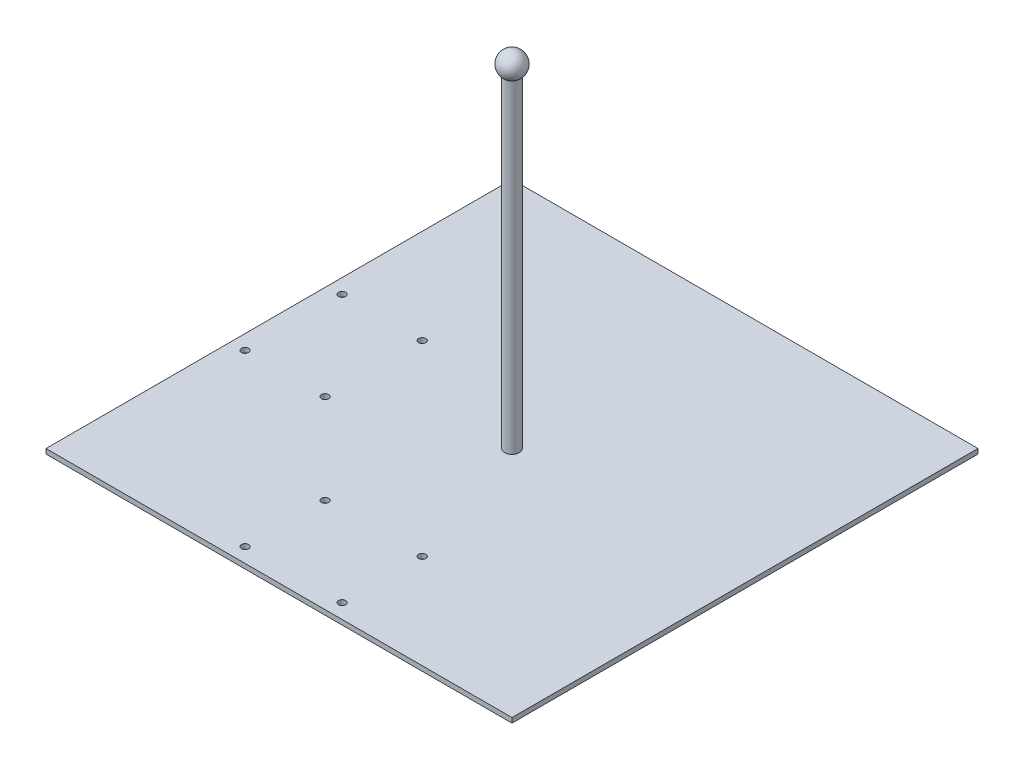
ISO-10303-21;
HEADER;
FILE_DESCRIPTION(('STEP AP214'),'2;1');
FILE_NAME('part.step','',(''),(''),'','','');
FILE_SCHEMA(('AUTOMOTIVE_DESIGN { 1 0 10303 214 1 1 1 1 }'));
ENDSEC;
DATA;
#1=APPLICATION_CONTEXT('core data for automotive mechanical design processes');
#2=APPLICATION_PROTOCOL_DEFINITION('international standard','automotive_design',2000,#1);
#3=PRODUCT_CONTEXT('',#1,'mechanical');
#4=PRODUCT('Part','Part','',(#3));
#5=PRODUCT_RELATED_PRODUCT_CATEGORY('part','',(#4));
#6=PRODUCT_DEFINITION_FORMATION('','',#4);
#7=PRODUCT_DEFINITION_CONTEXT('part definition',#1,'design');
#8=PRODUCT_DEFINITION('design','',#6,#7);
#9=PRODUCT_DEFINITION_SHAPE('','',#8);
#10=(LENGTH_UNIT() NAMED_UNIT(*) SI_UNIT(.MILLI.,.METRE.));
#11=(NAMED_UNIT(*) PLANE_ANGLE_UNIT() SI_UNIT($,.RADIAN.));
#12=(NAMED_UNIT(*) SI_UNIT($,.STERADIAN.) SOLID_ANGLE_UNIT());
#13=UNCERTAINTY_MEASURE_WITH_UNIT(LENGTH_MEASURE(1.E-05),#10,'distance_accuracy_value','');
#14=(GEOMETRIC_REPRESENTATION_CONTEXT(3) GLOBAL_UNCERTAINTY_ASSIGNED_CONTEXT((#13)) GLOBAL_UNIT_ASSIGNED_CONTEXT((#10,
#11,#12)) REPRESENTATION_CONTEXT('',''));
#15=CARTESIAN_POINT('',(0.,0.,0.));
#16=DIRECTION('',(0.,0.,1.));
#17=DIRECTION('',(1.,0.,0.));
#18=AXIS2_PLACEMENT_3D('',#15,#16,#17);
#19=CARTESIAN_POINT('',(-304.8,6.35,304.8));
#20=DIRECTION('',(0.,0.,-1.));
#21=DIRECTION('',(-1.,0.,0.));
#22=AXIS2_PLACEMENT_3D('',#19,#20,#21);
#23=PLANE('',#22);
#24=DIRECTION('',(1.,0.,0.));
#25=VECTOR('',#24,1.);
#26=CARTESIAN_POINT('',(-304.8,0.,304.8));
#27=LINE('',#26,#25);
#28=CARTESIAN_POINT('',(-304.8,0.,304.8));
#29=VERTEX_POINT('',#28);
#30=CARTESIAN_POINT('',(304.8,0.,304.8));
#31=VERTEX_POINT('',#30);
#32=EDGE_CURVE('E98',#29,#31,#27,.T.);
#33=ORIENTED_EDGE('',*,*,#32,.T.);
#34=DIRECTION('',(0.,-1.,0.));
#35=VECTOR('',#34,1.);
#36=CARTESIAN_POINT('',(304.8,6.35,304.8));
#37=LINE('',#36,#35);
#38=CARTESIAN_POINT('',(304.8,6.35,304.8));
#39=VERTEX_POINT('',#38);
#40=EDGE_CURVE('E11',#39,#31,#37,.T.);
#41=ORIENTED_EDGE('',*,*,#40,.F.);
#42=DIRECTION('',(1.,0.,0.));
#43=VECTOR('',#42,1.);
#44=CARTESIAN_POINT('',(-304.8,6.35,304.8));
#45=LINE('',#44,#43);
#46=CARTESIAN_POINT('',(-304.8,6.35,304.8));
#47=VERTEX_POINT('',#46);
#48=EDGE_CURVE('E83',#47,#39,#45,.T.);
#49=ORIENTED_EDGE('',*,*,#48,.F.);
#50=DIRECTION('',(0.,-1.,0.));
#51=VECTOR('',#50,1.);
#52=CARTESIAN_POINT('',(-304.8,6.35,304.8));
#53=LINE('',#52,#51);
#54=EDGE_CURVE('E50',#47,#29,#53,.T.);
#55=ORIENTED_EDGE('',*,*,#54,.T.);
#56=EDGE_LOOP('',(#33,#41,#49,#55));
#57=FACE_BOUND('',#56,.T.);
#58=ADVANCED_FACE('F33',(#57),#23,.F.);
#59=CARTESIAN_POINT('',(304.8,6.35,304.8));
#60=DIRECTION('',(-1.,0.,0.));
#61=DIRECTION('',(0.,0.,1.));
#62=AXIS2_PLACEMENT_3D('',#59,#60,#61);
#63=PLANE('',#62);
#64=DIRECTION('',(0.,0.,-1.));
#65=VECTOR('',#64,1.);
#66=CARTESIAN_POINT('',(304.8,0.,304.8));
#67=LINE('',#66,#65);
#68=CARTESIAN_POINT('',(304.8,0.,-304.8));
#69=VERTEX_POINT('',#68);
#70=EDGE_CURVE('E88',#31,#69,#67,.T.);
#71=ORIENTED_EDGE('',*,*,#70,.T.);
#72=DIRECTION('',(0.,-1.,0.));
#73=VECTOR('',#72,1.);
#74=CARTESIAN_POINT('',(304.8,6.35,-304.8));
#75=LINE('',#74,#73);
#76=CARTESIAN_POINT('',(304.8,6.35,-304.8));
#77=VERTEX_POINT('',#76);
#78=EDGE_CURVE('E42',#77,#69,#75,.T.);
#79=ORIENTED_EDGE('',*,*,#78,.F.);
#80=DIRECTION('',(0.,0.,-1.));
#81=VECTOR('',#80,1.);
#82=CARTESIAN_POINT('',(304.8,6.35,304.8));
#83=LINE('',#82,#81);
#84=EDGE_CURVE('E75',#39,#77,#83,.T.);
#85=ORIENTED_EDGE('',*,*,#84,.F.);
#86=ORIENTED_EDGE('',*,*,#40,.T.);
#87=EDGE_LOOP('',(#71,#79,#85,#86));
#88=FACE_BOUND('',#87,.T.);
#89=ADVANCED_FACE('F87',(#88),#63,.F.);
#90=CARTESIAN_POINT('',(-304.8,6.35,-304.8));
#91=DIRECTION('',(0.,0.,-1.));
#92=DIRECTION('',(-1.,0.,0.));
#93=AXIS2_PLACEMENT_3D('',#90,#91,#92);
#94=PLANE('',#93);
#95=DIRECTION('',(1.,0.,0.));
#96=VECTOR('',#95,1.);
#97=CARTESIAN_POINT('',(-304.8,0.,-304.8));
#98=LINE('',#97,#96);
#99=CARTESIAN_POINT('',(-304.8,0.,-304.8));
#100=VERTEX_POINT('',#99);
#101=EDGE_CURVE('E102',#100,#69,#98,.T.);
#102=ORIENTED_EDGE('',*,*,#101,.F.);
#103=DIRECTION('',(0.,-1.,0.));
#104=VECTOR('',#103,1.);
#105=CARTESIAN_POINT('',(-304.8,6.35,-304.8));
#106=LINE('',#105,#104);
#107=CARTESIAN_POINT('',(-304.8,6.35,-304.8));
#108=VERTEX_POINT('',#107);
#109=EDGE_CURVE('E64',#108,#100,#106,.T.);
#110=ORIENTED_EDGE('',*,*,#109,.F.);
#111=DIRECTION('',(1.,0.,0.));
#112=VECTOR('',#111,1.);
#113=CARTESIAN_POINT('',(-304.8,6.35,-304.8));
#114=LINE('',#113,#112);
#115=EDGE_CURVE('E82',#108,#77,#114,.T.);
#116=ORIENTED_EDGE('',*,*,#115,.T.);
#117=ORIENTED_EDGE('',*,*,#78,.T.);
#118=EDGE_LOOP('',(#102,#110,#116,#117));
#119=FACE_BOUND('',#118,.T.);
#120=ADVANCED_FACE('F92',(#119),#94,.T.);
#121=CARTESIAN_POINT('',(-304.8,6.35,304.8));
#122=DIRECTION('',(-1.,0.,0.));
#123=DIRECTION('',(0.,0.,1.));
#124=AXIS2_PLACEMENT_3D('',#121,#122,#123);
#125=PLANE('',#124);
#126=DIRECTION('',(0.,0.,-1.));
#127=VECTOR('',#126,1.);
#128=CARTESIAN_POINT('',(-304.8,0.,304.8));
#129=LINE('',#128,#127);
#130=EDGE_CURVE('E104',#29,#100,#129,.T.);
#131=ORIENTED_EDGE('',*,*,#130,.F.);
#132=ORIENTED_EDGE('',*,*,#54,.F.);
#133=DIRECTION('',(0.,0.,-1.));
#134=VECTOR('',#133,1.);
#135=CARTESIAN_POINT('',(-304.8,6.35,304.8));
#136=LINE('',#135,#134);
#137=EDGE_CURVE('E93',#47,#108,#136,.T.);
#138=ORIENTED_EDGE('',*,*,#137,.T.);
#139=ORIENTED_EDGE('',*,*,#109,.T.);
#140=EDGE_LOOP('',(#131,#132,#138,#139));
#141=FACE_BOUND('',#140,.T.);
#142=ADVANCED_FACE('F173',(#141),#125,.T.);
#143=CARTESIAN_POINT('',(0.,6.35,0.));
#144=DIRECTION('',(0.,1.,0.));
#145=DIRECTION('',(0.,0.,1.));
#146=AXIS2_PLACEMENT_3D('',#143,#144,#145);
#147=PLANE('',#146);
#148=CARTESIAN_POINT('',(0.,6.35,0.));
#149=DIRECTION('',(0.,1.,0.));
#150=DIRECTION('',(0.,0.,1.));
#151=AXIS2_PLACEMENT_3D('',#148,#149,#150);
#152=CIRCLE('',#151,9.525);
#153=CARTESIAN_POINT('',(0.,6.35,9.525));
#154=VERTEX_POINT('',#153);
#155=EDGE_CURVE('E155',#154,#154,#152,.T.);
#156=ORIENTED_EDGE('',*,*,#155,.F.);
#157=EDGE_LOOP('',(#156));
#158=FACE_BOUND('',#157,.T.);
#159=CARTESIAN_POINT('',(-63.5,6.35,285.75));
#160=DIRECTION('',(0.,1.,0.));
#161=DIRECTION('',(0.,0.,1.));
#162=AXIS2_PLACEMENT_3D('',#159,#160,#161);
#163=CIRCLE('',#162,4.7625);
#164=CARTESIAN_POINT('',(-63.5,6.35,290.5125));
#165=VERTEX_POINT('',#164);
#166=EDGE_CURVE('E151',#165,#165,#163,.T.);
#167=ORIENTED_EDGE('',*,*,#166,.F.);
#168=EDGE_LOOP('',(#167));
#169=FACE_BOUND('',#168,.T.);
#170=CARTESIAN_POINT('',(63.5,6.35,285.75));
#171=DIRECTION('',(0.,1.,0.));
#172=DIRECTION('',(0.,0.,1.));
#173=AXIS2_PLACEMENT_3D('',#170,#171,#172);
#174=CIRCLE('',#173,4.7625);
#175=CARTESIAN_POINT('',(63.5,6.35,290.5125));
#176=VERTEX_POINT('',#175);
#177=EDGE_CURVE('E145',#176,#176,#174,.T.);
#178=ORIENTED_EDGE('',*,*,#177,.F.);
#179=EDGE_LOOP('',(#178));
#180=FACE_BOUND('',#179,.T.);
#181=CARTESIAN_POINT('',(-285.75,6.35,-63.5));
#182=DIRECTION('',(0.,1.,0.));
#183=DIRECTION('',(0.,0.,1.));
#184=AXIS2_PLACEMENT_3D('',#181,#182,#183);
#185=CIRCLE('',#184,4.7625);
#186=CARTESIAN_POINT('',(-285.75,6.35,-58.7375));
#187=VERTEX_POINT('',#186);
#188=EDGE_CURVE('E139',#187,#187,#185,.T.);
#189=ORIENTED_EDGE('',*,*,#188,.F.);
#190=EDGE_LOOP('',(#189));
#191=FACE_BOUND('',#190,.T.);
#192=CARTESIAN_POINT('',(-285.75,6.35,63.5));
#193=DIRECTION('',(0.,1.,0.));
#194=DIRECTION('',(0.,0.,1.));
#195=AXIS2_PLACEMENT_3D('',#192,#193,#194);
#196=CIRCLE('',#195,4.7625);
#197=CARTESIAN_POINT('',(-285.75,6.35,68.2625));
#198=VERTEX_POINT('',#197);
#199=EDGE_CURVE('E133',#198,#198,#196,.T.);
#200=ORIENTED_EDGE('',*,*,#199,.F.);
#201=EDGE_LOOP('',(#200));
#202=FACE_BOUND('',#201,.T.);
#203=CARTESIAN_POINT('',(-63.5,6.35,180.975));
#204=DIRECTION('',(0.,1.,0.));
#205=DIRECTION('',(0.,0.,1.));
#206=AXIS2_PLACEMENT_3D('',#203,#204,#205);
#207=CIRCLE('',#206,4.7625);
#208=CARTESIAN_POINT('',(-63.5,6.35,185.7375));
#209=VERTEX_POINT('',#208);
#210=EDGE_CURVE('E127',#209,#209,#207,.T.);
#211=ORIENTED_EDGE('',*,*,#210,.F.);
#212=EDGE_LOOP('',(#211));
#213=FACE_BOUND('',#212,.T.);
#214=CARTESIAN_POINT('',(63.5,6.35,180.975));
#215=DIRECTION('',(0.,1.,0.));
#216=DIRECTION('',(0.,0.,1.));
#217=AXIS2_PLACEMENT_3D('',#214,#215,#216);
#218=CIRCLE('',#217,4.7625);
#219=CARTESIAN_POINT('',(63.5,6.35,185.7375));
#220=VERTEX_POINT('',#219);
#221=EDGE_CURVE('E124',#220,#220,#218,.T.);
#222=ORIENTED_EDGE('',*,*,#221,.F.);
#223=EDGE_LOOP('',(#222));
#224=FACE_BOUND('',#223,.T.);
#225=CARTESIAN_POINT('',(-180.975,6.35,63.5));
#226=DIRECTION('',(0.,1.,0.));
#227=DIRECTION('',(0.,0.,1.));
#228=AXIS2_PLACEMENT_3D('',#225,#226,#227);
#229=CIRCLE('',#228,4.7625);
#230=CARTESIAN_POINT('',(-180.975,6.35,68.2625));
#231=VERTEX_POINT('',#230);
#232=EDGE_CURVE('E118',#231,#231,#229,.T.);
#233=ORIENTED_EDGE('',*,*,#232,.F.);
#234=EDGE_LOOP('',(#233));
#235=FACE_BOUND('',#234,.T.);
#236=CARTESIAN_POINT('',(-180.975,6.35,-63.5));
#237=DIRECTION('',(0.,1.,0.));
#238=DIRECTION('',(0.,0.,1.));
#239=AXIS2_PLACEMENT_3D('',#236,#237,#238);
#240=CIRCLE('',#239,4.7625);
#241=CARTESIAN_POINT('',(-180.975,6.35,-58.7375));
#242=VERTEX_POINT('',#241);
#243=EDGE_CURVE('E112',#242,#242,#240,.T.);
#244=ORIENTED_EDGE('',*,*,#243,.F.);
#245=EDGE_LOOP('',(#244));
#246=FACE_BOUND('',#245,.T.);
#247=ORIENTED_EDGE('',*,*,#48,.T.);
#248=ORIENTED_EDGE('',*,*,#84,.T.);
#249=ORIENTED_EDGE('',*,*,#115,.F.);
#250=ORIENTED_EDGE('',*,*,#137,.F.);
#251=EDGE_LOOP('',(#247,#248,#249,#250));
#252=FACE_BOUND('',#251,.T.);
#253=ADVANCED_FACE('F79',(#158,#169,#180,#191,#202,#213,#224,#235,#246,#252),#147,.T.);
#254=CARTESIAN_POINT('',(0.,0.,0.));
#255=DIRECTION('',(0.,1.,0.));
#256=DIRECTION('',(0.,0.,1.));
#257=AXIS2_PLACEMENT_3D('',#254,#255,#256);
#258=PLANE('',#257);
#259=CARTESIAN_POINT('',(-63.5,0.,285.75));
#260=DIRECTION('',(0.,1.,0.));
#261=DIRECTION('',(0.,0.,1.));
#262=AXIS2_PLACEMENT_3D('',#259,#260,#261);
#263=CIRCLE('',#262,4.7625);
#264=CARTESIAN_POINT('',(-63.5,0.,290.5125));
#265=VERTEX_POINT('',#264);
#266=EDGE_CURVE('E148',#265,#265,#263,.T.);
#267=ORIENTED_EDGE('',*,*,#266,.T.);
#268=EDGE_LOOP('',(#267));
#269=FACE_BOUND('',#268,.T.);
#270=CARTESIAN_POINT('',(63.5,0.,285.75));
#271=DIRECTION('',(0.,1.,0.));
#272=DIRECTION('',(0.,0.,1.));
#273=AXIS2_PLACEMENT_3D('',#270,#271,#272);
#274=CIRCLE('',#273,4.7625);
#275=CARTESIAN_POINT('',(63.5,0.,290.5125));
#276=VERTEX_POINT('',#275);
#277=EDGE_CURVE('E142',#276,#276,#274,.T.);
#278=ORIENTED_EDGE('',*,*,#277,.T.);
#279=EDGE_LOOP('',(#278));
#280=FACE_BOUND('',#279,.T.);
#281=CARTESIAN_POINT('',(-285.75,0.,-63.5));
#282=DIRECTION('',(0.,1.,0.));
#283=DIRECTION('',(0.,0.,1.));
#284=AXIS2_PLACEMENT_3D('',#281,#282,#283);
#285=CIRCLE('',#284,4.7625);
#286=CARTESIAN_POINT('',(-285.75,0.,-58.7375));
#287=VERTEX_POINT('',#286);
#288=EDGE_CURVE('E136',#287,#287,#285,.T.);
#289=ORIENTED_EDGE('',*,*,#288,.T.);
#290=EDGE_LOOP('',(#289));
#291=FACE_BOUND('',#290,.T.);
#292=CARTESIAN_POINT('',(-285.75,0.,63.5));
#293=DIRECTION('',(0.,1.,0.));
#294=DIRECTION('',(0.,0.,1.));
#295=AXIS2_PLACEMENT_3D('',#292,#293,#294);
#296=CIRCLE('',#295,4.7625);
#297=CARTESIAN_POINT('',(-285.75,0.,68.2625));
#298=VERTEX_POINT('',#297);
#299=EDGE_CURVE('E130',#298,#298,#296,.T.);
#300=ORIENTED_EDGE('',*,*,#299,.T.);
#301=EDGE_LOOP('',(#300));
#302=FACE_BOUND('',#301,.T.);
#303=CARTESIAN_POINT('',(-63.5,0.,180.975));
#304=DIRECTION('',(0.,1.,0.));
#305=DIRECTION('',(0.,0.,1.));
#306=AXIS2_PLACEMENT_3D('',#303,#304,#305);
#307=CIRCLE('',#306,4.7625);
#308=CARTESIAN_POINT('',(-63.5,0.,185.7375));
#309=VERTEX_POINT('',#308);
#310=EDGE_CURVE('E36',#309,#309,#307,.T.);
#311=ORIENTED_EDGE('',*,*,#310,.T.);
#312=EDGE_LOOP('',(#311));
#313=FACE_BOUND('',#312,.T.);
#314=CARTESIAN_POINT('',(63.5,0.,180.975));
#315=DIRECTION('',(0.,1.,0.));
#316=DIRECTION('',(0.,0.,1.));
#317=AXIS2_PLACEMENT_3D('',#314,#315,#316);
#318=CIRCLE('',#317,4.7625);
#319=CARTESIAN_POINT('',(63.5,0.,185.7375));
#320=VERTEX_POINT('',#319);
#321=EDGE_CURVE('E121',#320,#320,#318,.T.);
#322=ORIENTED_EDGE('',*,*,#321,.T.);
#323=EDGE_LOOP('',(#322));
#324=FACE_BOUND('',#323,.T.);
#325=CARTESIAN_POINT('',(-180.975,0.,63.5));
#326=DIRECTION('',(0.,1.,0.));
#327=DIRECTION('',(0.,0.,1.));
#328=AXIS2_PLACEMENT_3D('',#325,#326,#327);
#329=CIRCLE('',#328,4.7625);
#330=CARTESIAN_POINT('',(-180.975,0.,68.2625));
#331=VERTEX_POINT('',#330);
#332=EDGE_CURVE('E115',#331,#331,#329,.T.);
#333=ORIENTED_EDGE('',*,*,#332,.T.);
#334=EDGE_LOOP('',(#333));
#335=FACE_BOUND('',#334,.T.);
#336=CARTESIAN_POINT('',(-180.975,0.,-63.5));
#337=DIRECTION('',(0.,1.,0.));
#338=DIRECTION('',(0.,0.,1.));
#339=AXIS2_PLACEMENT_3D('',#336,#337,#338);
#340=CIRCLE('',#339,4.7625);
#341=CARTESIAN_POINT('',(-180.975,0.,-58.7375));
#342=VERTEX_POINT('',#341);
#343=EDGE_CURVE('E100',#342,#342,#340,.T.);
#344=ORIENTED_EDGE('',*,*,#343,.T.);
#345=EDGE_LOOP('',(#344));
#346=FACE_BOUND('',#345,.T.);
#347=ORIENTED_EDGE('',*,*,#32,.F.);
#348=ORIENTED_EDGE('',*,*,#130,.T.);
#349=ORIENTED_EDGE('',*,*,#101,.T.);
#350=ORIENTED_EDGE('',*,*,#70,.F.);
#351=EDGE_LOOP('',(#347,#348,#349,#350));
#352=FACE_BOUND('',#351,.T.);
#353=ADVANCED_FACE('F172',(#269,#280,#291,#302,#313,#324,#335,#346,#352),#258,.F.);
#354=CARTESIAN_POINT('',(-180.975,6.35,-63.5));
#355=DIRECTION('',(0.,1.,0.));
#356=DIRECTION('',(0.,0.,1.));
#357=AXIS2_PLACEMENT_3D('',#354,#355,#356);
#358=CYLINDRICAL_SURFACE('',#357,4.7625);
#359=ORIENTED_EDGE('',*,*,#243,.T.);
#360=EDGE_LOOP('',(#359));
#361=FACE_BOUND('',#360,.T.);
#362=ORIENTED_EDGE('',*,*,#343,.F.);
#363=EDGE_LOOP('',(#362));
#364=FACE_BOUND('',#363,.T.);
#365=ADVANCED_FACE('F191',(#361,#364),#358,.F.);
#366=CARTESIAN_POINT('',(-180.975,6.35,63.5));
#367=DIRECTION('',(0.,1.,0.));
#368=DIRECTION('',(0.,0.,1.));
#369=AXIS2_PLACEMENT_3D('',#366,#367,#368);
#370=CYLINDRICAL_SURFACE('',#369,4.7625);
#371=ORIENTED_EDGE('',*,*,#232,.T.);
#372=EDGE_LOOP('',(#371));
#373=FACE_BOUND('',#372,.T.);
#374=ORIENTED_EDGE('',*,*,#332,.F.);
#375=EDGE_LOOP('',(#374));
#376=FACE_BOUND('',#375,.T.);
#377=ADVANCED_FACE('F194',(#373,#376),#370,.F.);
#378=CARTESIAN_POINT('',(63.5,6.35,180.975));
#379=DIRECTION('',(0.,1.,0.));
#380=DIRECTION('',(0.,0.,1.));
#381=AXIS2_PLACEMENT_3D('',#378,#379,#380);
#382=CYLINDRICAL_SURFACE('',#381,4.7625);
#383=ORIENTED_EDGE('',*,*,#221,.T.);
#384=EDGE_LOOP('',(#383));
#385=FACE_BOUND('',#384,.T.);
#386=ORIENTED_EDGE('',*,*,#321,.F.);
#387=EDGE_LOOP('',(#386));
#388=FACE_BOUND('',#387,.T.);
#389=ADVANCED_FACE('F243',(#385,#388),#382,.F.);
#390=CARTESIAN_POINT('',(-63.5,6.35,180.975));
#391=DIRECTION('',(0.,1.,0.));
#392=DIRECTION('',(0.,0.,1.));
#393=AXIS2_PLACEMENT_3D('',#390,#391,#392);
#394=CYLINDRICAL_SURFACE('',#393,4.7625);
#395=ORIENTED_EDGE('',*,*,#210,.T.);
#396=EDGE_LOOP('',(#395));
#397=FACE_BOUND('',#396,.T.);
#398=ORIENTED_EDGE('',*,*,#310,.F.);
#399=EDGE_LOOP('',(#398));
#400=FACE_BOUND('',#399,.T.);
#401=ADVANCED_FACE('F253',(#397,#400),#394,.F.);
#402=CARTESIAN_POINT('',(-285.75,6.35,63.5));
#403=DIRECTION('',(0.,1.,0.));
#404=DIRECTION('',(0.,0.,1.));
#405=AXIS2_PLACEMENT_3D('',#402,#403,#404);
#406=CYLINDRICAL_SURFACE('',#405,4.7625);
#407=ORIENTED_EDGE('',*,*,#199,.T.);
#408=EDGE_LOOP('',(#407));
#409=FACE_BOUND('',#408,.T.);
#410=ORIENTED_EDGE('',*,*,#299,.F.);
#411=EDGE_LOOP('',(#410));
#412=FACE_BOUND('',#411,.T.);
#413=ADVANCED_FACE('F263',(#409,#412),#406,.F.);
#414=CARTESIAN_POINT('',(-285.75,6.35,-63.5));
#415=DIRECTION('',(0.,1.,0.));
#416=DIRECTION('',(0.,0.,1.));
#417=AXIS2_PLACEMENT_3D('',#414,#415,#416);
#418=CYLINDRICAL_SURFACE('',#417,4.7625);
#419=ORIENTED_EDGE('',*,*,#188,.T.);
#420=EDGE_LOOP('',(#419));
#421=FACE_BOUND('',#420,.T.);
#422=ORIENTED_EDGE('',*,*,#288,.F.);
#423=EDGE_LOOP('',(#422));
#424=FACE_BOUND('',#423,.T.);
#425=ADVANCED_FACE('F273',(#421,#424),#418,.F.);
#426=CARTESIAN_POINT('',(63.5,6.35,285.75));
#427=DIRECTION('',(0.,1.,0.));
#428=DIRECTION('',(0.,0.,1.));
#429=AXIS2_PLACEMENT_3D('',#426,#427,#428);
#430=CYLINDRICAL_SURFACE('',#429,4.7625);
#431=ORIENTED_EDGE('',*,*,#177,.T.);
#432=EDGE_LOOP('',(#431));
#433=FACE_BOUND('',#432,.T.);
#434=ORIENTED_EDGE('',*,*,#277,.F.);
#435=EDGE_LOOP('',(#434));
#436=FACE_BOUND('',#435,.T.);
#437=ADVANCED_FACE('F283',(#433,#436),#430,.F.);
#438=CARTESIAN_POINT('',(-63.5,6.35,285.75));
#439=DIRECTION('',(0.,1.,0.));
#440=DIRECTION('',(0.,0.,1.));
#441=AXIS2_PLACEMENT_3D('',#438,#439,#440);
#442=CYLINDRICAL_SURFACE('',#441,4.7625);
#443=ORIENTED_EDGE('',*,*,#166,.T.);
#444=EDGE_LOOP('',(#443));
#445=FACE_BOUND('',#444,.T.);
#446=ORIENTED_EDGE('',*,*,#266,.F.);
#447=EDGE_LOOP('',(#446));
#448=FACE_BOUND('',#447,.T.);
#449=ADVANCED_FACE('F166',(#445,#448),#442,.F.);
#450=CARTESIAN_POINT('',(0.,429.26,0.));
#451=DIRECTION('',(0.,-1.,0.));
#452=DIRECTION('',(0.,0.,-1.));
#453=AXIS2_PLACEMENT_3D('',#450,#451,#452);
#454=CYLINDRICAL_SURFACE('',#453,9.525);
#455=CARTESIAN_POINT('',(0.,429.26,0.));
#456=DIRECTION('',(0.,1.,0.));
#457=DIRECTION('',(0.,0.,1.));
#458=AXIS2_PLACEMENT_3D('',#455,#456,#457);
#459=CIRCLE('',#458,9.525);
#460=CARTESIAN_POINT('',(0.,429.26,9.525));
#461=VERTEX_POINT('',#460);
#462=EDGE_CURVE('E154',#461,#461,#459,.T.);
#463=ORIENTED_EDGE('',*,*,#462,.F.);
#464=EDGE_LOOP('',(#463));
#465=FACE_BOUND('',#464,.T.);
#466=ORIENTED_EDGE('',*,*,#155,.T.);
#467=EDGE_LOOP('',(#466));
#468=FACE_BOUND('',#467,.T.);
#469=ADVANCED_FACE('F163',(#465,#468),#454,.T.);
#470=CARTESIAN_POINT('',(0.,441.96,0.));
#471=DIRECTION('',(0.,1.,0.));
#472=DIRECTION('',(1.,0.,0.));
#473=AXIS2_PLACEMENT_3D('',#470,#471,#472);
#474=SPHERICAL_SURFACE('',#473,15.875);
#475=ORIENTED_EDGE('',*,*,#462,.T.);
#476=EDGE_LOOP('',(#475));
#477=FACE_BOUND('',#476,.T.);
#478=ADVANCED_FACE('F161',(#477),#474,.T.);
#479=CLOSED_SHELL('',(#58,#89,#120,#142,#253,#353,#365,#377,#389,#401,#413,#425,#437,#449,#469,#478));
#480=MANIFOLD_SOLID_BREP('B2',#479);
#481=ADVANCED_BREP_SHAPE_REPRESENTATION('',(#18,#480),#14);
#482=SHAPE_DEFINITION_REPRESENTATION(#9,#481);
ENDSEC;
END-ISO-10303-21;
